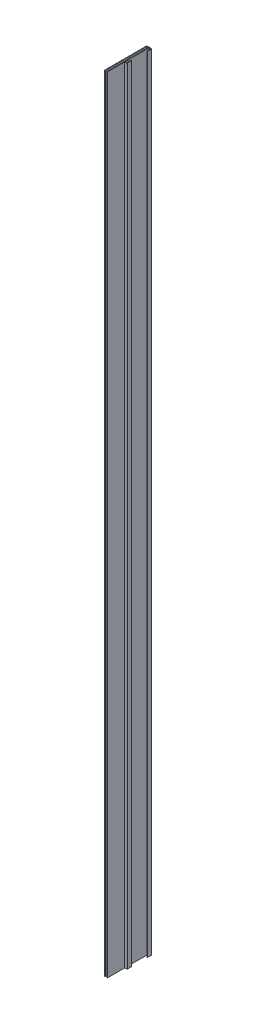
ISO-10303-21;
HEADER;
FILE_DESCRIPTION(('STEP AP214'),'2;1');
FILE_NAME('part.step','',(''),(''),'','','');
FILE_SCHEMA(('AUTOMOTIVE_DESIGN { 1 0 10303 214 1 1 1 1 }'));
ENDSEC;
DATA;
#1=APPLICATION_CONTEXT('core data for automotive mechanical design processes');
#2=APPLICATION_PROTOCOL_DEFINITION('international standard','automotive_design',2000,#1);
#3=PRODUCT_CONTEXT('',#1,'mechanical');
#4=PRODUCT('Part','Part','',(#3));
#5=PRODUCT_RELATED_PRODUCT_CATEGORY('part','',(#4));
#6=PRODUCT_DEFINITION_FORMATION('','',#4);
#7=PRODUCT_DEFINITION_CONTEXT('part definition',#1,'design');
#8=PRODUCT_DEFINITION('design','',#6,#7);
#9=PRODUCT_DEFINITION_SHAPE('','',#8);
#10=(LENGTH_UNIT() NAMED_UNIT(*) SI_UNIT(.MILLI.,.METRE.));
#11=(NAMED_UNIT(*) PLANE_ANGLE_UNIT() SI_UNIT($,.RADIAN.));
#12=(NAMED_UNIT(*) SI_UNIT($,.STERADIAN.) SOLID_ANGLE_UNIT());
#13=UNCERTAINTY_MEASURE_WITH_UNIT(LENGTH_MEASURE(1.E-05),#10,'distance_accuracy_value','');
#14=(GEOMETRIC_REPRESENTATION_CONTEXT(3) GLOBAL_UNCERTAINTY_ASSIGNED_CONTEXT((#13)) GLOBAL_UNIT_ASSIGNED_CONTEXT((#10,
#11,#12)) REPRESENTATION_CONTEXT('',''));
#15=CARTESIAN_POINT('',(0.,0.,0.));
#16=DIRECTION('',(0.,0.,1.));
#17=DIRECTION('',(1.,0.,0.));
#18=AXIS2_PLACEMENT_3D('',#15,#16,#17);
#19=CARTESIAN_POINT('',(2.5,-900.,-0.8));
#20=DIRECTION('',(0.,0.,-1.));
#21=DIRECTION('',(-1.,0.,0.));
#22=AXIS2_PLACEMENT_3D('',#19,#20,#21);
#23=PLANE('',#22);
#24=DIRECTION('',(-1.,0.,0.));
#25=VECTOR('',#24,1.);
#26=CARTESIAN_POINT('',(2.5,100.,-0.8));
#27=LINE('',#26,#25);
#28=CARTESIAN_POINT('',(2.5,100.,-0.8));
#29=VERTEX_POINT('',#28);
#30=CARTESIAN_POINT('',(0.4,100.,-0.8));
#31=VERTEX_POINT('',#30);
#32=EDGE_CURVE('E203',#29,#31,#27,.T.);
#33=ORIENTED_EDGE('',*,*,#32,.F.);
#34=DIRECTION('',(0.,1.,0.));
#35=VECTOR('',#34,1.);
#36=CARTESIAN_POINT('',(2.5,-900.,-0.8));
#37=LINE('',#36,#35);
#38=CARTESIAN_POINT('',(2.5,-900.,-0.8));
#39=VERTEX_POINT('',#38);
#40=EDGE_CURVE('E10',#39,#29,#37,.T.);
#41=ORIENTED_EDGE('',*,*,#40,.F.);
#42=DIRECTION('',(-1.,0.,0.));
#43=VECTOR('',#42,1.);
#44=CARTESIAN_POINT('',(2.5,-900.,-0.8));
#45=LINE('',#44,#43);
#46=CARTESIAN_POINT('',(0.4,-900.,-0.8));
#47=VERTEX_POINT('',#46);
#48=EDGE_CURVE('E268',#39,#47,#45,.T.);
#49=ORIENTED_EDGE('',*,*,#48,.T.);
#50=DIRECTION('',(0.,1.,0.));
#51=VECTOR('',#50,1.);
#52=CARTESIAN_POINT('',(0.4,-900.,-0.8));
#53=LINE('',#52,#51);
#54=EDGE_CURVE('E19',#47,#31,#53,.T.);
#55=ORIENTED_EDGE('',*,*,#54,.T.);
#56=EDGE_LOOP('',(#33,#41,#49,#55));
#57=FACE_BOUND('',#56,.T.);
#58=ADVANCED_FACE('F16',(#57),#23,.T.);
#59=CARTESIAN_POINT('',(2.5,-900.,-4.95));
#60=DIRECTION('',(-1.,0.,0.));
#61=DIRECTION('',(0.,0.,1.));
#62=AXIS2_PLACEMENT_3D('',#59,#60,#61);
#63=PLANE('',#62);
#64=DIRECTION('',(0.,0.,1.));
#65=VECTOR('',#64,1.);
#66=CARTESIAN_POINT('',(2.5,100.,-4.95));
#67=LINE('',#66,#65);
#68=CARTESIAN_POINT('',(2.5,100.,-4.95));
#69=VERTEX_POINT('',#68);
#70=EDGE_CURVE('E266',#69,#29,#67,.T.);
#71=ORIENTED_EDGE('',*,*,#70,.F.);
#72=DIRECTION('',(0.,1.,0.));
#73=VECTOR('',#72,1.);
#74=CARTESIAN_POINT('',(2.5,-900.,-4.95));
#75=LINE('',#74,#73);
#76=CARTESIAN_POINT('',(2.5,-900.,-4.95));
#77=VERTEX_POINT('',#76);
#78=EDGE_CURVE('E25',#77,#69,#75,.T.);
#79=ORIENTED_EDGE('',*,*,#78,.F.);
#80=DIRECTION('',(0.,0.,1.));
#81=VECTOR('',#80,1.);
#82=CARTESIAN_POINT('',(2.5,-900.,-4.95));
#83=LINE('',#82,#81);
#84=EDGE_CURVE('E193',#77,#39,#83,.T.);
#85=ORIENTED_EDGE('',*,*,#84,.T.);
#86=ORIENTED_EDGE('',*,*,#40,.T.);
#87=EDGE_LOOP('',(#71,#79,#85,#86));
#88=FACE_BOUND('',#87,.T.);
#89=ADVANCED_FACE('F310',(#88),#63,.T.);
#90=CARTESIAN_POINT('',(3.3,-900.,-4.95));
#91=DIRECTION('',(0.,1.,0.));
#92=DIRECTION('',(0.,0.,1.));
#93=AXIS2_PLACEMENT_3D('',#90,#91,#92);
#94=CYLINDRICAL_SURFACE('',#93,0.8);
#95=CARTESIAN_POINT('',(3.3,100.,-4.95));
#96=DIRECTION('',(0.,1.,0.));
#97=DIRECTION('',(0.,0.,1.));
#98=AXIS2_PLACEMENT_3D('',#95,#96,#97);
#99=CIRCLE('',#98,0.8);
#100=CARTESIAN_POINT('',(3.3,100.,-5.75));
#101=VERTEX_POINT('',#100);
#102=EDGE_CURVE('E180',#101,#69,#99,.T.);
#103=ORIENTED_EDGE('',*,*,#102,.F.);
#104=DIRECTION('',(0.,1.,0.));
#105=VECTOR('',#104,1.);
#106=CARTESIAN_POINT('',(3.3,-900.,-5.75));
#107=LINE('',#106,#105);
#108=CARTESIAN_POINT('',(3.3,-900.,-5.75));
#109=VERTEX_POINT('',#108);
#110=EDGE_CURVE('E175',#109,#101,#107,.T.);
#111=ORIENTED_EDGE('',*,*,#110,.F.);
#112=CARTESIAN_POINT('',(3.3,-900.,-4.95));
#113=DIRECTION('',(0.,1.,0.));
#114=DIRECTION('',(0.,0.,1.));
#115=AXIS2_PLACEMENT_3D('',#112,#113,#114);
#116=CIRCLE('',#115,0.8);
#117=EDGE_CURVE('E178',#109,#77,#116,.T.);
#118=ORIENTED_EDGE('',*,*,#117,.T.);
#119=ORIENTED_EDGE('',*,*,#78,.T.);
#120=EDGE_LOOP('',(#103,#111,#118,#119));
#121=FACE_BOUND('',#120,.T.);
#122=ADVANCED_FACE('F177',(#121),#94,.T.);
#123=CARTESIAN_POINT('',(3.3,-900.,-0.8));
#124=DIRECTION('',(1.,0.,0.));
#125=DIRECTION('',(0.,0.,-1.));
#126=AXIS2_PLACEMENT_3D('',#123,#124,#125);
#127=PLANE('',#126);
#128=DIRECTION('',(0.,0.,-1.));
#129=VECTOR('',#128,1.);
#130=CARTESIAN_POINT('',(3.3,100.,-0.8));
#131=LINE('',#130,#129);
#132=CARTESIAN_POINT('',(3.3,100.,-0.8));
#133=VERTEX_POINT('',#132);
#134=EDGE_CURVE('E263',#133,#101,#131,.T.);
#135=ORIENTED_EDGE('',*,*,#134,.F.);
#136=DIRECTION('',(0.,1.,0.));
#137=VECTOR('',#136,1.);
#138=CARTESIAN_POINT('',(3.3,-900.,-0.8));
#139=LINE('',#138,#137);
#140=CARTESIAN_POINT('',(3.3,-900.,-0.8));
#141=VERTEX_POINT('',#140);
#142=EDGE_CURVE('E185',#141,#133,#139,.T.);
#143=ORIENTED_EDGE('',*,*,#142,.F.);
#144=DIRECTION('',(0.,0.,-1.));
#145=VECTOR('',#144,1.);
#146=CARTESIAN_POINT('',(3.3,-900.,-0.8));
#147=LINE('',#146,#145);
#148=EDGE_CURVE('E191',#141,#109,#147,.T.);
#149=ORIENTED_EDGE('',*,*,#148,.T.);
#150=ORIENTED_EDGE('',*,*,#110,.T.);
#151=EDGE_LOOP('',(#135,#143,#149,#150));
#152=FACE_BOUND('',#151,.T.);
#153=ADVANCED_FACE('F195',(#152),#127,.T.);
#154=CARTESIAN_POINT('',(2.5,-900.,-0.8));
#155=DIRECTION('',(0.,1.,0.));
#156=DIRECTION('',(0.,0.,1.));
#157=AXIS2_PLACEMENT_3D('',#154,#155,#156);
#158=CYLINDRICAL_SURFACE('',#157,0.8);
#159=CARTESIAN_POINT('',(2.5,100.,-0.8));
#160=DIRECTION('',(0.,1.,0.));
#161=DIRECTION('',(0.,0.,1.));
#162=AXIS2_PLACEMENT_3D('',#159,#160,#161);
#163=CIRCLE('',#162,0.8);
#164=CARTESIAN_POINT('',(2.5,100.,0.));
#165=VERTEX_POINT('',#164);
#166=EDGE_CURVE('E260',#165,#133,#163,.T.);
#167=ORIENTED_EDGE('',*,*,#166,.F.);
#168=DIRECTION('',(0.,1.,0.));
#169=VECTOR('',#168,1.);
#170=CARTESIAN_POINT('',(2.5,-900.,0.));
#171=LINE('',#170,#169);
#172=CARTESIAN_POINT('',(2.5,-900.,0.));
#173=VERTEX_POINT('',#172);
#174=EDGE_CURVE('E272',#173,#165,#171,.T.);
#175=ORIENTED_EDGE('',*,*,#174,.F.);
#176=CARTESIAN_POINT('',(2.5,-900.,-0.8));
#177=DIRECTION('',(0.,1.,0.));
#178=DIRECTION('',(0.,0.,1.));
#179=AXIS2_PLACEMENT_3D('',#176,#177,#178);
#180=CIRCLE('',#179,0.8);
#181=EDGE_CURVE('E196',#173,#141,#180,.T.);
#182=ORIENTED_EDGE('',*,*,#181,.T.);
#183=ORIENTED_EDGE('',*,*,#142,.T.);
#184=EDGE_LOOP('',(#167,#175,#182,#183));
#185=FACE_BOUND('',#184,.T.);
#186=ADVANCED_FACE('F324',(#185),#158,.T.);
#187=CARTESIAN_POINT('',(0.4,-900.,0.));
#188=DIRECTION('',(0.,0.,1.));
#189=DIRECTION('',(1.,0.,0.));
#190=AXIS2_PLACEMENT_3D('',#187,#188,#189);
#191=PLANE('',#190);
#192=DIRECTION('',(1.,0.,0.));
#193=VECTOR('',#192,1.);
#194=CARTESIAN_POINT('',(0.4,100.,0.));
#195=LINE('',#194,#193);
#196=CARTESIAN_POINT('',(0.4,100.,0.));
#197=VERTEX_POINT('',#196);
#198=EDGE_CURVE('E257',#197,#165,#195,.T.);
#199=ORIENTED_EDGE('',*,*,#198,.F.);
#200=DIRECTION('',(0.,1.,0.));
#201=VECTOR('',#200,1.);
#202=CARTESIAN_POINT('',(0.4,-900.,0.));
#203=LINE('',#202,#201);
#204=CARTESIAN_POINT('',(0.4,-900.,0.));
#205=VERTEX_POINT('',#204);
#206=EDGE_CURVE('E274',#205,#197,#203,.T.);
#207=ORIENTED_EDGE('',*,*,#206,.F.);
#208=DIRECTION('',(1.,0.,0.));
#209=VECTOR('',#208,1.);
#210=CARTESIAN_POINT('',(0.4,-900.,0.));
#211=LINE('',#210,#209);
#212=EDGE_CURVE('E198',#205,#173,#211,.T.);
#213=ORIENTED_EDGE('',*,*,#212,.T.);
#214=ORIENTED_EDGE('',*,*,#174,.T.);
#215=EDGE_LOOP('',(#199,#207,#213,#214));
#216=FACE_BOUND('',#215,.T.);
#217=ADVANCED_FACE('F327',(#216),#191,.T.);
#218=CARTESIAN_POINT('',(0.4,-900.,22.));
#219=DIRECTION('',(1.,0.,0.));
#220=DIRECTION('',(0.,0.,-1.));
#221=AXIS2_PLACEMENT_3D('',#218,#219,#220);
#222=PLANE('',#221);
#223=DIRECTION('',(0.,0.,-1.));
#224=VECTOR('',#223,1.);
#225=CARTESIAN_POINT('',(0.4,100.,22.));
#226=LINE('',#225,#224);
#227=CARTESIAN_POINT('',(0.4,100.,22.));
#228=VERTEX_POINT('',#227);
#229=EDGE_CURVE('E254',#228,#197,#226,.T.);
#230=ORIENTED_EDGE('',*,*,#229,.F.);
#231=DIRECTION('',(0.,1.,0.));
#232=VECTOR('',#231,1.);
#233=CARTESIAN_POINT('',(0.4,-900.,22.));
#234=LINE('',#233,#232);
#235=CARTESIAN_POINT('',(0.4,-900.,22.));
#236=VERTEX_POINT('',#235);
#237=EDGE_CURVE('E276',#236,#228,#234,.T.);
#238=ORIENTED_EDGE('',*,*,#237,.F.);
#239=DIRECTION('',(0.,0.,-1.));
#240=VECTOR('',#239,1.);
#241=CARTESIAN_POINT('',(0.4,-900.,22.));
#242=LINE('',#241,#240);
#243=EDGE_CURVE('E614',#236,#205,#242,.T.);
#244=ORIENTED_EDGE('',*,*,#243,.T.);
#245=ORIENTED_EDGE('',*,*,#206,.T.);
#246=EDGE_LOOP('',(#230,#238,#244,#245));
#247=FACE_BOUND('',#246,.T.);
#248=ADVANCED_FACE('F331',(#247),#222,.T.);
#249=CARTESIAN_POINT('',(0.1,-900.,22.));
#250=DIRECTION('',(0.,0.,1.));
#251=DIRECTION('',(1.,0.,0.));
#252=AXIS2_PLACEMENT_3D('',#249,#250,#251);
#253=PLANE('',#252);
#254=DIRECTION('',(1.,0.,0.));
#255=VECTOR('',#254,1.);
#256=CARTESIAN_POINT('',(0.1,100.,22.));
#257=LINE('',#256,#255);
#258=CARTESIAN_POINT('',(0.1,100.,22.));
#259=VERTEX_POINT('',#258);
#260=EDGE_CURVE('E251',#259,#228,#257,.T.);
#261=ORIENTED_EDGE('',*,*,#260,.F.);
#262=DIRECTION('',(0.,1.,0.));
#263=VECTOR('',#262,1.);
#264=CARTESIAN_POINT('',(0.1,-900.,22.));
#265=LINE('',#264,#263);
#266=CARTESIAN_POINT('',(0.1,-900.,22.));
#267=VERTEX_POINT('',#266);
#268=EDGE_CURVE('E278',#267,#259,#265,.T.);
#269=ORIENTED_EDGE('',*,*,#268,.F.);
#270=DIRECTION('',(1.,0.,0.));
#271=VECTOR('',#270,1.);
#272=CARTESIAN_POINT('',(0.1,-900.,22.));
#273=LINE('',#272,#271);
#274=EDGE_CURVE('E607',#267,#236,#273,.T.);
#275=ORIENTED_EDGE('',*,*,#274,.T.);
#276=ORIENTED_EDGE('',*,*,#237,.T.);
#277=EDGE_LOOP('',(#261,#269,#275,#276));
#278=FACE_BOUND('',#277,.T.);
#279=ADVANCED_FACE('F335',(#278),#253,.T.);
#280=CARTESIAN_POINT('',(-0.4,-900.,21.5));
#281=DIRECTION('',(-0.707106781186548,0.,0.707106781186547));
#282=DIRECTION('',(0.707106781186547,0.,0.707106781186548));
#283=AXIS2_PLACEMENT_3D('',#280,#281,#282);
#284=PLANE('',#283);
#285=DIRECTION('',(0.707106781186547,0.,0.707106781186548));
#286=VECTOR('',#285,1.);
#287=CARTESIAN_POINT('',(-0.4,100.,21.5));
#288=LINE('',#287,#286);
#289=CARTESIAN_POINT('',(-0.4,100.,21.5));
#290=VERTEX_POINT('',#289);
#291=EDGE_CURVE('E248',#290,#259,#288,.T.);
#292=ORIENTED_EDGE('',*,*,#291,.F.);
#293=DIRECTION('',(0.,1.,0.));
#294=VECTOR('',#293,1.);
#295=CARTESIAN_POINT('',(-0.4,-900.,21.5));
#296=LINE('',#295,#294);
#297=CARTESIAN_POINT('',(-0.4,-900.,21.5));
#298=VERTEX_POINT('',#297);
#299=EDGE_CURVE('E280',#298,#290,#296,.T.);
#300=ORIENTED_EDGE('',*,*,#299,.F.);
#301=DIRECTION('',(0.707106781186547,0.,0.707106781186548));
#302=VECTOR('',#301,1.);
#303=CARTESIAN_POINT('',(-0.4,-900.,21.5));
#304=LINE('',#303,#302);
#305=EDGE_CURVE('E603',#298,#267,#304,.T.);
#306=ORIENTED_EDGE('',*,*,#305,.T.);
#307=ORIENTED_EDGE('',*,*,#268,.T.);
#308=EDGE_LOOP('',(#292,#300,#306,#307));
#309=FACE_BOUND('',#308,.T.);
#310=ADVANCED_FACE('F339',(#309),#284,.T.);
#311=CARTESIAN_POINT('',(-0.4,-900.,-31.2));
#312=DIRECTION('',(-1.,0.,0.));
#313=DIRECTION('',(0.,0.,1.));
#314=AXIS2_PLACEMENT_3D('',#311,#312,#313);
#315=PLANE('',#314);
#316=DIRECTION('',(0.,0.,1.));
#317=VECTOR('',#316,1.);
#318=CARTESIAN_POINT('',(-0.4,100.,-31.2));
#319=LINE('',#318,#317);
#320=CARTESIAN_POINT('',(-0.4,100.,-31.2));
#321=VERTEX_POINT('',#320);
#322=EDGE_CURVE('E245',#321,#290,#319,.T.);
#323=ORIENTED_EDGE('',*,*,#322,.F.);
#324=DIRECTION('',(0.,1.,0.));
#325=VECTOR('',#324,1.);
#326=CARTESIAN_POINT('',(-0.4,-900.,-31.2));
#327=LINE('',#326,#325);
#328=CARTESIAN_POINT('',(-0.4,-900.,-31.2));
#329=VERTEX_POINT('',#328);
#330=EDGE_CURVE('E282',#329,#321,#327,.T.);
#331=ORIENTED_EDGE('',*,*,#330,.F.);
#332=DIRECTION('',(0.,0.,1.));
#333=VECTOR('',#332,1.);
#334=CARTESIAN_POINT('',(-0.4,-900.,-31.2));
#335=LINE('',#334,#333);
#336=EDGE_CURVE('E619',#329,#298,#335,.T.);
#337=ORIENTED_EDGE('',*,*,#336,.T.);
#338=ORIENTED_EDGE('',*,*,#299,.T.);
#339=EDGE_LOOP('',(#323,#331,#337,#338));
#340=FACE_BOUND('',#339,.T.);
#341=ADVANCED_FACE('F343',(#340),#315,.T.);
#342=CARTESIAN_POINT('',(-2.5,-900.,-31.2));
#343=DIRECTION('',(0.,0.,1.));
#344=DIRECTION('',(1.,0.,0.));
#345=AXIS2_PLACEMENT_3D('',#342,#343,#344);
#346=PLANE('',#345);
#347=DIRECTION('',(1.,0.,0.));
#348=VECTOR('',#347,1.);
#349=CARTESIAN_POINT('',(-2.5,100.,-31.2));
#350=LINE('',#349,#348);
#351=CARTESIAN_POINT('',(-2.5,100.,-31.2));
#352=VERTEX_POINT('',#351);
#353=EDGE_CURVE('E242',#352,#321,#350,.T.);
#354=ORIENTED_EDGE('',*,*,#353,.F.);
#355=DIRECTION('',(0.,1.,0.));
#356=VECTOR('',#355,1.);
#357=CARTESIAN_POINT('',(-2.5,-900.,-31.2));
#358=LINE('',#357,#356);
#359=CARTESIAN_POINT('',(-2.5,-900.,-31.2));
#360=VERTEX_POINT('',#359);
#361=EDGE_CURVE('E284',#360,#352,#358,.T.);
#362=ORIENTED_EDGE('',*,*,#361,.F.);
#363=DIRECTION('',(1.,0.,0.));
#364=VECTOR('',#363,1.);
#365=CARTESIAN_POINT('',(-2.5,-900.,-31.2));
#366=LINE('',#365,#364);
#367=EDGE_CURVE('E596',#360,#329,#366,.T.);
#368=ORIENTED_EDGE('',*,*,#367,.T.);
#369=ORIENTED_EDGE('',*,*,#330,.T.);
#370=EDGE_LOOP('',(#354,#362,#368,#369));
#371=FACE_BOUND('',#370,.T.);
#372=ADVANCED_FACE('F347',(#371),#346,.T.);
#373=CARTESIAN_POINT('',(-2.5,-900.,21.5));
#374=DIRECTION('',(1.,0.,0.));
#375=DIRECTION('',(0.,0.,-1.));
#376=AXIS2_PLACEMENT_3D('',#373,#374,#375);
#377=PLANE('',#376);
#378=DIRECTION('',(0.,0.,-1.));
#379=VECTOR('',#378,1.);
#380=CARTESIAN_POINT('',(-2.5,100.,21.5));
#381=LINE('',#380,#379);
#382=CARTESIAN_POINT('',(-2.5,100.,21.5));
#383=VERTEX_POINT('',#382);
#384=EDGE_CURVE('E239',#383,#352,#381,.T.);
#385=ORIENTED_EDGE('',*,*,#384,.F.);
#386=DIRECTION('',(0.,1.,0.));
#387=VECTOR('',#386,1.);
#388=CARTESIAN_POINT('',(-2.5,-900.,21.5));
#389=LINE('',#388,#387);
#390=CARTESIAN_POINT('',(-2.5,-900.,21.5));
#391=VERTEX_POINT('',#390);
#392=EDGE_CURVE('E286',#391,#383,#389,.T.);
#393=ORIENTED_EDGE('',*,*,#392,.F.);
#394=DIRECTION('',(0.,0.,-1.));
#395=VECTOR('',#394,1.);
#396=CARTESIAN_POINT('',(-2.5,-900.,21.5));
#397=LINE('',#396,#395);
#398=EDGE_CURVE('E592',#391,#360,#397,.T.);
#399=ORIENTED_EDGE('',*,*,#398,.T.);
#400=ORIENTED_EDGE('',*,*,#361,.T.);
#401=EDGE_LOOP('',(#385,#393,#399,#400));
#402=FACE_BOUND('',#401,.T.);
#403=ADVANCED_FACE('F351',(#402),#377,.T.);
#404=CARTESIAN_POINT('',(-3.,-900.,22.));
#405=DIRECTION('',(0.707106781186548,0.,0.707106781186547));
#406=DIRECTION('',(0.707106781186547,0.,-0.707106781186548));
#407=AXIS2_PLACEMENT_3D('',#404,#405,#406);
#408=PLANE('',#407);
#409=DIRECTION('',(0.707106781186547,0.,-0.707106781186548));
#410=VECTOR('',#409,1.);
#411=CARTESIAN_POINT('',(-3.,100.,22.));
#412=LINE('',#411,#410);
#413=CARTESIAN_POINT('',(-3.,100.,22.));
#414=VERTEX_POINT('',#413);
#415=EDGE_CURVE('E236',#414,#383,#412,.T.);
#416=ORIENTED_EDGE('',*,*,#415,.F.);
#417=DIRECTION('',(0.,1.,0.));
#418=VECTOR('',#417,1.);
#419=CARTESIAN_POINT('',(-3.,-900.,22.));
#420=LINE('',#419,#418);
#421=CARTESIAN_POINT('',(-3.,-900.,22.));
#422=VERTEX_POINT('',#421);
#423=EDGE_CURVE('E288',#422,#414,#420,.T.);
#424=ORIENTED_EDGE('',*,*,#423,.F.);
#425=DIRECTION('',(0.707106781186547,0.,-0.707106781186548));
#426=VECTOR('',#425,1.);
#427=CARTESIAN_POINT('',(-3.,-900.,22.));
#428=LINE('',#427,#426);
#429=EDGE_CURVE('E623',#422,#391,#428,.T.);
#430=ORIENTED_EDGE('',*,*,#429,.T.);
#431=ORIENTED_EDGE('',*,*,#392,.T.);
#432=EDGE_LOOP('',(#416,#424,#430,#431));
#433=FACE_BOUND('',#432,.T.);
#434=ADVANCED_FACE('F355',(#433),#408,.T.);
#435=CARTESIAN_POINT('',(-3.3,-900.,22.));
#436=DIRECTION('',(0.,0.,1.));
#437=DIRECTION('',(1.,0.,0.));
#438=AXIS2_PLACEMENT_3D('',#435,#436,#437);
#439=PLANE('',#438);
#440=DIRECTION('',(1.,0.,0.));
#441=VECTOR('',#440,1.);
#442=CARTESIAN_POINT('',(-3.3,100.,22.));
#443=LINE('',#442,#441);
#444=CARTESIAN_POINT('',(-3.3,100.,22.));
#445=VERTEX_POINT('',#444);
#446=EDGE_CURVE('E233',#445,#414,#443,.T.);
#447=ORIENTED_EDGE('',*,*,#446,.F.);
#448=DIRECTION('',(0.,1.,0.));
#449=VECTOR('',#448,1.);
#450=CARTESIAN_POINT('',(-3.3,-900.,22.));
#451=LINE('',#450,#449);
#452=CARTESIAN_POINT('',(-3.3,-900.,22.));
#453=VERTEX_POINT('',#452);
#454=EDGE_CURVE('E290',#453,#445,#451,.T.);
#455=ORIENTED_EDGE('',*,*,#454,.F.);
#456=DIRECTION('',(1.,0.,0.));
#457=VECTOR('',#456,1.);
#458=CARTESIAN_POINT('',(-3.3,-900.,22.));
#459=LINE('',#458,#457);
#460=EDGE_CURVE('E585',#453,#422,#459,.T.);
#461=ORIENTED_EDGE('',*,*,#460,.T.);
#462=ORIENTED_EDGE('',*,*,#423,.T.);
#463=EDGE_LOOP('',(#447,#455,#461,#462));
#464=FACE_BOUND('',#463,.T.);
#465=ADVANCED_FACE('F359',(#464),#439,.T.);
#466=CARTESIAN_POINT('',(-3.3,-900.,-31.2));
#467=DIRECTION('',(-1.,0.,0.));
#468=DIRECTION('',(0.,0.,1.));
#469=AXIS2_PLACEMENT_3D('',#466,#467,#468);
#470=PLANE('',#469);
#471=DIRECTION('',(0.,0.,1.));
#472=VECTOR('',#471,1.);
#473=CARTESIAN_POINT('',(-3.3,100.,-31.2));
#474=LINE('',#473,#472);
#475=CARTESIAN_POINT('',(-3.3,100.,-31.2));
#476=VERTEX_POINT('',#475);
#477=EDGE_CURVE('E230',#476,#445,#474,.T.);
#478=ORIENTED_EDGE('',*,*,#477,.F.);
#479=DIRECTION('',(0.,1.,0.));
#480=VECTOR('',#479,1.);
#481=CARTESIAN_POINT('',(-3.3,-900.,-31.2));
#482=LINE('',#481,#480);
#483=CARTESIAN_POINT('',(-3.3,-900.,-31.2));
#484=VERTEX_POINT('',#483);
#485=EDGE_CURVE('E292',#484,#476,#482,.T.);
#486=ORIENTED_EDGE('',*,*,#485,.F.);
#487=DIRECTION('',(0.,0.,1.));
#488=VECTOR('',#487,1.);
#489=CARTESIAN_POINT('',(-3.3,-900.,-31.2));
#490=LINE('',#489,#488);
#491=EDGE_CURVE('E581',#484,#453,#490,.T.);
#492=ORIENTED_EDGE('',*,*,#491,.T.);
#493=ORIENTED_EDGE('',*,*,#454,.T.);
#494=EDGE_LOOP('',(#478,#486,#492,#493));
#495=FACE_BOUND('',#494,.T.);
#496=ADVANCED_FACE('F363',(#495),#470,.T.);
#497=CARTESIAN_POINT('',(-2.5,-900.,-31.2));
#498=DIRECTION('',(0.,1.,0.));
#499=DIRECTION('',(0.,0.,1.));
#500=AXIS2_PLACEMENT_3D('',#497,#498,#499);
#501=CYLINDRICAL_SURFACE('',#500,0.800000000000001);
#502=CARTESIAN_POINT('',(-2.5,100.,-31.2));
#503=DIRECTION('',(0.,1.,0.));
#504=DIRECTION('',(0.,0.,1.));
#505=AXIS2_PLACEMENT_3D('',#502,#503,#504);
#506=CIRCLE('',#505,0.800000000000001);
#507=CARTESIAN_POINT('',(-2.5,100.,-32.));
#508=VERTEX_POINT('',#507);
#509=EDGE_CURVE('E227',#508,#476,#506,.T.);
#510=ORIENTED_EDGE('',*,*,#509,.F.);
#511=DIRECTION('',(0.,1.,0.));
#512=VECTOR('',#511,1.);
#513=CARTESIAN_POINT('',(-2.5,-900.,-32.));
#514=LINE('',#513,#512);
#515=CARTESIAN_POINT('',(-2.5,-900.,-32.));
#516=VERTEX_POINT('',#515);
#517=EDGE_CURVE('E294',#516,#508,#514,.T.);
#518=ORIENTED_EDGE('',*,*,#517,.F.);
#519=CARTESIAN_POINT('',(-2.5,-900.,-31.2));
#520=DIRECTION('',(0.,1.,0.));
#521=DIRECTION('',(0.,0.,1.));
#522=AXIS2_PLACEMENT_3D('',#519,#520,#521);
#523=CIRCLE('',#522,0.800000000000001);
#524=EDGE_CURVE('E627',#516,#484,#523,.T.);
#525=ORIENTED_EDGE('',*,*,#524,.T.);
#526=ORIENTED_EDGE('',*,*,#485,.T.);
#527=EDGE_LOOP('',(#510,#518,#525,#526));
#528=FACE_BOUND('',#527,.T.);
#529=ADVANCED_FACE('F367',(#528),#501,.T.);
#530=CARTESIAN_POINT('',(2.5,-900.,-32.));
#531=DIRECTION('',(0.,0.,-1.));
#532=DIRECTION('',(-1.,0.,0.));
#533=AXIS2_PLACEMENT_3D('',#530,#531,#532);
#534=PLANE('',#533);
#535=DIRECTION('',(-1.,0.,0.));
#536=VECTOR('',#535,1.);
#537=CARTESIAN_POINT('',(2.5,100.,-32.));
#538=LINE('',#537,#536);
#539=CARTESIAN_POINT('',(2.5,100.,-32.));
#540=VERTEX_POINT('',#539);
#541=EDGE_CURVE('E224',#540,#508,#538,.T.);
#542=ORIENTED_EDGE('',*,*,#541,.F.);
#543=DIRECTION('',(0.,1.,0.));
#544=VECTOR('',#543,1.);
#545=CARTESIAN_POINT('',(2.5,-900.,-32.));
#546=LINE('',#545,#544);
#547=CARTESIAN_POINT('',(2.5,-900.,-32.));
#548=VERTEX_POINT('',#547);
#549=EDGE_CURVE('E296',#548,#540,#546,.T.);
#550=ORIENTED_EDGE('',*,*,#549,.F.);
#551=DIRECTION('',(-1.,0.,0.));
#552=VECTOR('',#551,1.);
#553=CARTESIAN_POINT('',(2.5,-900.,-32.));
#554=LINE('',#553,#552);
#555=EDGE_CURVE('E574',#548,#516,#554,.T.);
#556=ORIENTED_EDGE('',*,*,#555,.T.);
#557=ORIENTED_EDGE('',*,*,#517,.T.);
#558=EDGE_LOOP('',(#542,#550,#556,#557));
#559=FACE_BOUND('',#558,.T.);
#560=ADVANCED_FACE('F371',(#559),#534,.T.);
#561=CARTESIAN_POINT('',(2.5,-900.,-31.2));
#562=DIRECTION('',(0.,1.,0.));
#563=DIRECTION('',(0.,0.,1.));
#564=AXIS2_PLACEMENT_3D('',#561,#562,#563);
#565=CYLINDRICAL_SURFACE('',#564,0.800000000000001);
#566=CARTESIAN_POINT('',(2.5,100.,-31.2));
#567=DIRECTION('',(0.,1.,0.));
#568=DIRECTION('',(0.,0.,1.));
#569=AXIS2_PLACEMENT_3D('',#566,#567,#568);
#570=CIRCLE('',#569,0.800000000000001);
#571=CARTESIAN_POINT('',(3.3,100.,-31.2));
#572=VERTEX_POINT('',#571);
#573=EDGE_CURVE('E221',#572,#540,#570,.T.);
#574=ORIENTED_EDGE('',*,*,#573,.F.);
#575=DIRECTION('',(0.,1.,0.));
#576=VECTOR('',#575,1.);
#577=CARTESIAN_POINT('',(3.3,-900.,-31.2));
#578=LINE('',#577,#576);
#579=CARTESIAN_POINT('',(3.3,-900.,-31.2));
#580=VERTEX_POINT('',#579);
#581=EDGE_CURVE('E298',#580,#572,#578,.T.);
#582=ORIENTED_EDGE('',*,*,#581,.F.);
#583=CARTESIAN_POINT('',(2.5,-900.,-31.2));
#584=DIRECTION('',(0.,1.,0.));
#585=DIRECTION('',(0.,0.,1.));
#586=AXIS2_PLACEMENT_3D('',#583,#584,#585);
#587=CIRCLE('',#586,0.800000000000001);
#588=EDGE_CURVE('E570',#580,#548,#587,.T.);
#589=ORIENTED_EDGE('',*,*,#588,.T.);
#590=ORIENTED_EDGE('',*,*,#549,.T.);
#591=EDGE_LOOP('',(#574,#582,#589,#590));
#592=FACE_BOUND('',#591,.T.);
#593=ADVANCED_FACE('F375',(#592),#565,.T.);
#594=CARTESIAN_POINT('',(3.3,-900.,-26.25));
#595=DIRECTION('',(1.,0.,0.));
#596=DIRECTION('',(0.,0.,-1.));
#597=AXIS2_PLACEMENT_3D('',#594,#595,#596);
#598=PLANE('',#597);
#599=DIRECTION('',(0.,0.,-1.));
#600=VECTOR('',#599,1.);
#601=CARTESIAN_POINT('',(3.3,100.,-26.25));
#602=LINE('',#601,#600);
#603=CARTESIAN_POINT('',(3.3,100.,-26.25));
#604=VERTEX_POINT('',#603);
#605=EDGE_CURVE('E218',#604,#572,#602,.T.);
#606=ORIENTED_EDGE('',*,*,#605,.F.);
#607=DIRECTION('',(0.,1.,0.));
#608=VECTOR('',#607,1.);
#609=CARTESIAN_POINT('',(3.3,-900.,-26.25));
#610=LINE('',#609,#608);
#611=CARTESIAN_POINT('',(3.3,-900.,-26.25));
#612=VERTEX_POINT('',#611);
#613=EDGE_CURVE('E300',#612,#604,#610,.T.);
#614=ORIENTED_EDGE('',*,*,#613,.F.);
#615=DIRECTION('',(0.,0.,-1.));
#616=VECTOR('',#615,1.);
#617=CARTESIAN_POINT('',(3.3,-900.,-26.25));
#618=LINE('',#617,#616);
#619=EDGE_CURVE('E631',#612,#580,#618,.T.);
#620=ORIENTED_EDGE('',*,*,#619,.T.);
#621=ORIENTED_EDGE('',*,*,#581,.T.);
#622=EDGE_LOOP('',(#606,#614,#620,#621));
#623=FACE_BOUND('',#622,.T.);
#624=ADVANCED_FACE('F379',(#623),#598,.T.);
#625=CARTESIAN_POINT('',(2.5,-900.,-26.25));
#626=DIRECTION('',(0.,0.,1.));
#627=DIRECTION('',(1.,0.,0.));
#628=AXIS2_PLACEMENT_3D('',#625,#626,#627);
#629=PLANE('',#628);
#630=DIRECTION('',(1.,0.,0.));
#631=VECTOR('',#630,1.);
#632=CARTESIAN_POINT('',(2.5,100.,-26.25));
#633=LINE('',#632,#631);
#634=CARTESIAN_POINT('',(2.5,100.,-26.25));
#635=VERTEX_POINT('',#634);
#636=EDGE_CURVE('E215',#635,#604,#633,.T.);
#637=ORIENTED_EDGE('',*,*,#636,.F.);
#638=DIRECTION('',(0.,1.,0.));
#639=VECTOR('',#638,1.);
#640=CARTESIAN_POINT('',(2.5,-900.,-26.25));
#641=LINE('',#640,#639);
#642=CARTESIAN_POINT('',(2.5,-900.,-26.25));
#643=VERTEX_POINT('',#642);
#644=EDGE_CURVE('E302',#643,#635,#641,.T.);
#645=ORIENTED_EDGE('',*,*,#644,.F.);
#646=DIRECTION('',(1.,0.,0.));
#647=VECTOR('',#646,1.);
#648=CARTESIAN_POINT('',(2.5,-900.,-26.25));
#649=LINE('',#648,#647);
#650=EDGE_CURVE('E563',#643,#612,#649,.T.);
#651=ORIENTED_EDGE('',*,*,#650,.T.);
#652=ORIENTED_EDGE('',*,*,#613,.T.);
#653=EDGE_LOOP('',(#637,#645,#651,#652));
#654=FACE_BOUND('',#653,.T.);
#655=ADVANCED_FACE('F383',(#654),#629,.T.);
#656=CARTESIAN_POINT('',(2.5,-900.,-31.2));
#657=DIRECTION('',(-1.,0.,0.));
#658=DIRECTION('',(0.,0.,1.));
#659=AXIS2_PLACEMENT_3D('',#656,#657,#658);
#660=PLANE('',#659);
#661=DIRECTION('',(0.,0.,1.));
#662=VECTOR('',#661,1.);
#663=CARTESIAN_POINT('',(2.5,100.,-31.2));
#664=LINE('',#663,#662);
#665=CARTESIAN_POINT('',(2.5,100.,-31.2));
#666=VERTEX_POINT('',#665);
#667=EDGE_CURVE('E212',#666,#635,#664,.T.);
#668=ORIENTED_EDGE('',*,*,#667,.F.);
#669=DIRECTION('',(0.,1.,0.));
#670=VECTOR('',#669,1.);
#671=CARTESIAN_POINT('',(2.5,-900.,-31.2));
#672=LINE('',#671,#670);
#673=CARTESIAN_POINT('',(2.5,-900.,-31.2));
#674=VERTEX_POINT('',#673);
#675=EDGE_CURVE('E304',#674,#666,#672,.T.);
#676=ORIENTED_EDGE('',*,*,#675,.F.);
#677=DIRECTION('',(0.,0.,1.));
#678=VECTOR('',#677,1.);
#679=CARTESIAN_POINT('',(2.5,-900.,-31.2));
#680=LINE('',#679,#678);
#681=EDGE_CURVE('E559',#674,#643,#680,.T.);
#682=ORIENTED_EDGE('',*,*,#681,.T.);
#683=ORIENTED_EDGE('',*,*,#644,.T.);
#684=EDGE_LOOP('',(#668,#676,#682,#683));
#685=FACE_BOUND('',#684,.T.);
#686=ADVANCED_FACE('F387',(#685),#660,.T.);
#687=CARTESIAN_POINT('',(0.4,-900.,-31.2));
#688=DIRECTION('',(0.,0.,1.));
#689=DIRECTION('',(1.,0.,0.));
#690=AXIS2_PLACEMENT_3D('',#687,#688,#689);
#691=PLANE('',#690);
#692=DIRECTION('',(1.,0.,0.));
#693=VECTOR('',#692,1.);
#694=CARTESIAN_POINT('',(0.4,100.,-31.2));
#695=LINE('',#694,#693);
#696=CARTESIAN_POINT('',(0.4,100.,-31.2));
#697=VERTEX_POINT('',#696);
#698=EDGE_CURVE('E209',#697,#666,#695,.T.);
#699=ORIENTED_EDGE('',*,*,#698,.F.);
#700=DIRECTION('',(0.,1.,0.));
#701=VECTOR('',#700,1.);
#702=CARTESIAN_POINT('',(0.4,-900.,-31.2));
#703=LINE('',#702,#701);
#704=CARTESIAN_POINT('',(0.4,-900.,-31.2));
#705=VERTEX_POINT('',#704);
#706=EDGE_CURVE('E305',#705,#697,#703,.T.);
#707=ORIENTED_EDGE('',*,*,#706,.F.);
#708=DIRECTION('',(1.,0.,0.));
#709=VECTOR('',#708,1.);
#710=CARTESIAN_POINT('',(0.4,-900.,-31.2));
#711=LINE('',#710,#709);
#712=EDGE_CURVE('E635',#705,#674,#711,.T.);
#713=ORIENTED_EDGE('',*,*,#712,.T.);
#714=ORIENTED_EDGE('',*,*,#675,.T.);
#715=EDGE_LOOP('',(#699,#707,#713,#714));
#716=FACE_BOUND('',#715,.T.);
#717=ADVANCED_FACE('F391',(#716),#691,.T.);
#718=CARTESIAN_POINT('',(0.4,-900.,-0.8));
#719=DIRECTION('',(1.,0.,0.));
#720=DIRECTION('',(0.,0.,-1.));
#721=AXIS2_PLACEMENT_3D('',#718,#719,#720);
#722=PLANE('',#721);
#723=DIRECTION('',(0.,0.,-1.));
#724=VECTOR('',#723,1.);
#725=CARTESIAN_POINT('',(0.4,100.,-0.8));
#726=LINE('',#725,#724);
#727=EDGE_CURVE('E206',#31,#697,#726,.T.);
#728=ORIENTED_EDGE('',*,*,#727,.F.);
#729=ORIENTED_EDGE('',*,*,#54,.F.);
#730=DIRECTION('',(0.,0.,-1.));
#731=VECTOR('',#730,1.);
#732=CARTESIAN_POINT('',(0.4,-900.,-0.8));
#733=LINE('',#732,#731);
#734=EDGE_CURVE('E637',#47,#705,#733,.T.);
#735=ORIENTED_EDGE('',*,*,#734,.T.);
#736=ORIENTED_EDGE('',*,*,#706,.T.);
#737=EDGE_LOOP('',(#728,#729,#735,#736));
#738=FACE_BOUND('',#737,.T.);
#739=ADVANCED_FACE('F307',(#738),#722,.T.);
#740=CARTESIAN_POINT('',(2.5,-900.,-31.2));
#741=DIRECTION('',(0.,1.,0.));
#742=DIRECTION('',(0.,0.,1.));
#743=AXIS2_PLACEMENT_3D('',#740,#741,#742);
#744=PLANE('',#743);
#745=ORIENTED_EDGE('',*,*,#48,.F.);
#746=ORIENTED_EDGE('',*,*,#84,.F.);
#747=ORIENTED_EDGE('',*,*,#117,.F.);
#748=ORIENTED_EDGE('',*,*,#148,.F.);
#749=ORIENTED_EDGE('',*,*,#181,.F.);
#750=ORIENTED_EDGE('',*,*,#212,.F.);
#751=ORIENTED_EDGE('',*,*,#243,.F.);
#752=ORIENTED_EDGE('',*,*,#274,.F.);
#753=ORIENTED_EDGE('',*,*,#305,.F.);
#754=ORIENTED_EDGE('',*,*,#336,.F.);
#755=ORIENTED_EDGE('',*,*,#367,.F.);
#756=ORIENTED_EDGE('',*,*,#398,.F.);
#757=ORIENTED_EDGE('',*,*,#429,.F.);
#758=ORIENTED_EDGE('',*,*,#460,.F.);
#759=ORIENTED_EDGE('',*,*,#491,.F.);
#760=ORIENTED_EDGE('',*,*,#524,.F.);
#761=ORIENTED_EDGE('',*,*,#555,.F.);
#762=ORIENTED_EDGE('',*,*,#588,.F.);
#763=ORIENTED_EDGE('',*,*,#619,.F.);
#764=ORIENTED_EDGE('',*,*,#650,.F.);
#765=ORIENTED_EDGE('',*,*,#681,.F.);
#766=ORIENTED_EDGE('',*,*,#712,.F.);
#767=ORIENTED_EDGE('',*,*,#734,.F.);
#768=EDGE_LOOP('',(#745,#746,#747,#748,#749,#750,#751,#752,#753,#754,#755,#756,#757,#758,#759,
#760,#761,#762,#763,#764,#765,#766,#767));
#769=FACE_BOUND('',#768,.T.);
#770=ADVANCED_FACE('F189',(#769),#744,.F.);
#771=CARTESIAN_POINT('',(2.5,100.,-31.2));
#772=DIRECTION('',(0.,1.,0.));
#773=DIRECTION('',(0.,0.,1.));
#774=AXIS2_PLACEMENT_3D('',#771,#772,#773);
#775=PLANE('',#774);
#776=ORIENTED_EDGE('',*,*,#32,.T.);
#777=ORIENTED_EDGE('',*,*,#727,.T.);
#778=ORIENTED_EDGE('',*,*,#698,.T.);
#779=ORIENTED_EDGE('',*,*,#667,.T.);
#780=ORIENTED_EDGE('',*,*,#636,.T.);
#781=ORIENTED_EDGE('',*,*,#605,.T.);
#782=ORIENTED_EDGE('',*,*,#573,.T.);
#783=ORIENTED_EDGE('',*,*,#541,.T.);
#784=ORIENTED_EDGE('',*,*,#509,.T.);
#785=ORIENTED_EDGE('',*,*,#477,.T.);
#786=ORIENTED_EDGE('',*,*,#446,.T.);
#787=ORIENTED_EDGE('',*,*,#415,.T.);
#788=ORIENTED_EDGE('',*,*,#384,.T.);
#789=ORIENTED_EDGE('',*,*,#353,.T.);
#790=ORIENTED_EDGE('',*,*,#322,.T.);
#791=ORIENTED_EDGE('',*,*,#291,.T.);
#792=ORIENTED_EDGE('',*,*,#260,.T.);
#793=ORIENTED_EDGE('',*,*,#229,.T.);
#794=ORIENTED_EDGE('',*,*,#198,.T.);
#795=ORIENTED_EDGE('',*,*,#166,.T.);
#796=ORIENTED_EDGE('',*,*,#134,.T.);
#797=ORIENTED_EDGE('',*,*,#102,.T.);
#798=ORIENTED_EDGE('',*,*,#70,.T.);
#799=EDGE_LOOP('',(#776,#777,#778,#779,#780,#781,#782,#783,#784,#785,#786,#787,#788,#789,#790,
#791,#792,#793,#794,#795,#796,#797,#798));
#800=FACE_BOUND('',#799,.T.);
#801=ADVANCED_FACE('F309',(#800),#775,.T.);
#802=CLOSED_SHELL('',(#58,#89,#122,#153,#186,#217,#248,#279,#310,#341,#372,#403,#434,#465,#496,
#529,#560,#593,#624,#655,#686,#717,#739,#770,#801));
#803=MANIFOLD_SOLID_BREP('B1',#802);
#804=ADVANCED_BREP_SHAPE_REPRESENTATION('',(#18,#803),#14);
#805=SHAPE_DEFINITION_REPRESENTATION(#9,#804);
ENDSEC;
END-ISO-10303-21;
